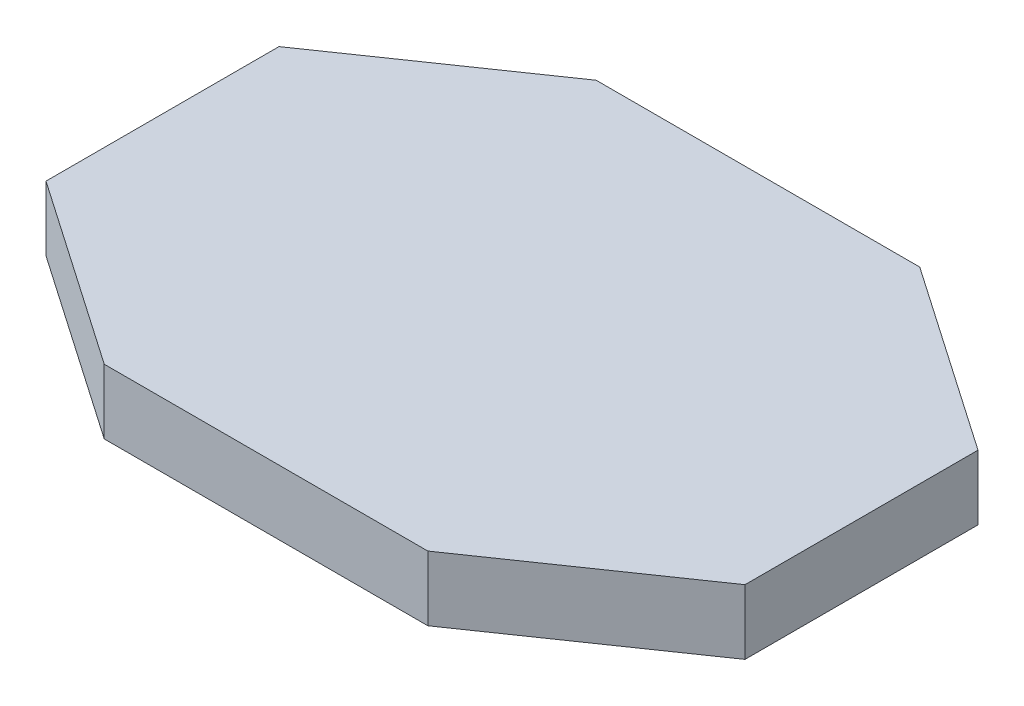
ISO-10303-21;
HEADER;
FILE_DESCRIPTION(('STEP AP214'),'2;1');
FILE_NAME('part.step','',(''),(''),'','','');
FILE_SCHEMA(('AUTOMOTIVE_DESIGN { 1 0 10303 214 1 1 1 1 }'));
ENDSEC;
DATA;
#1=APPLICATION_CONTEXT('core data for automotive mechanical design processes');
#2=APPLICATION_PROTOCOL_DEFINITION('international standard','automotive_design',2000,#1);
#3=PRODUCT_CONTEXT('',#1,'mechanical');
#4=PRODUCT('Part','Part','',(#3));
#5=PRODUCT_RELATED_PRODUCT_CATEGORY('part','',(#4));
#6=PRODUCT_DEFINITION_FORMATION('','',#4);
#7=PRODUCT_DEFINITION_CONTEXT('part definition',#1,'design');
#8=PRODUCT_DEFINITION('design','',#6,#7);
#9=PRODUCT_DEFINITION_SHAPE('','',#8);
#10=(LENGTH_UNIT() NAMED_UNIT(*) SI_UNIT(.MILLI.,.METRE.));
#11=(NAMED_UNIT(*) PLANE_ANGLE_UNIT() SI_UNIT($,.RADIAN.));
#12=(NAMED_UNIT(*) SI_UNIT($,.STERADIAN.) SOLID_ANGLE_UNIT());
#13=UNCERTAINTY_MEASURE_WITH_UNIT(LENGTH_MEASURE(1.E-05),#10,'distance_accuracy_value','');
#14=(GEOMETRIC_REPRESENTATION_CONTEXT(3) GLOBAL_UNCERTAINTY_ASSIGNED_CONTEXT((#13)) GLOBAL_UNIT_ASSIGNED_CONTEXT((#10,
#11,#12)) REPRESENTATION_CONTEXT('',''));
#15=CARTESIAN_POINT('',(0.,0.,0.));
#16=DIRECTION('',(0.,0.,1.));
#17=DIRECTION('',(1.,0.,0.));
#18=AXIS2_PLACEMENT_3D('',#15,#16,#17);
#19=CARTESIAN_POINT('',(0.,5.,0.));
#20=DIRECTION('',(0.,1.,0.));
#21=DIRECTION('',(0.,0.,1.));
#22=AXIS2_PLACEMENT_3D('',#19,#20,#21);
#23=PLANE('',#22);
#24=DIRECTION('',(-1.,0.,0.));
#25=VECTOR('',#24,1.);
#26=CARTESIAN_POINT('',(12.5,5.,-19.));
#27=LINE('',#26,#25);
#28=CARTESIAN_POINT('',(-12.5,5.,-19.));
#29=VERTEX_POINT('',#28);
#30=CARTESIAN_POINT('',(12.5000000000001,5.,-19.0000000000001));
#31=VERTEX_POINT('',#30);
#32=EDGE_CURVE('E93',#29,#31,#27,.F.);
#33=ORIENTED_EDGE('',*,*,#32,.F.);
#34=DIRECTION('',(-0.823212785915285,0.,0.56773295580369));
#35=VECTOR('',#34,1.);
#36=CARTESIAN_POINT('',(-12.5,5.,-19.));
#37=LINE('',#36,#35);
#38=CARTESIAN_POINT('',(-26.9999999999999,5.,-8.99999999999986));
#39=VERTEX_POINT('',#38);
#40=EDGE_CURVE('E19',#39,#29,#37,.F.);
#41=ORIENTED_EDGE('',*,*,#40,.F.);
#42=DIRECTION('',(0.,0.,1.));
#43=VECTOR('',#42,1.);
#44=CARTESIAN_POINT('',(-27.,5.,-9.));
#45=LINE('',#44,#43);
#46=CARTESIAN_POINT('',(-27.,5.,9.));
#47=VERTEX_POINT('',#46);
#48=EDGE_CURVE('E82',#47,#39,#45,.F.);
#49=ORIENTED_EDGE('',*,*,#48,.F.);
#50=DIRECTION('',(0.823212785915285,0.,0.56773295580369));
#51=VECTOR('',#50,1.);
#52=CARTESIAN_POINT('',(-27.,5.,9.));
#53=LINE('',#52,#51);
#54=CARTESIAN_POINT('',(-12.5000000000001,5.,19.0000000000001));
#55=VERTEX_POINT('',#54);
#56=EDGE_CURVE('E77',#55,#47,#53,.F.);
#57=ORIENTED_EDGE('',*,*,#56,.F.);
#58=DIRECTION('',(1.,0.,0.));
#59=VECTOR('',#58,1.);
#60=CARTESIAN_POINT('',(-12.5,5.,19.));
#61=LINE('',#60,#59);
#62=CARTESIAN_POINT('',(12.5,5.,19.));
#63=VERTEX_POINT('',#62);
#64=EDGE_CURVE('E104',#63,#55,#61,.F.);
#65=ORIENTED_EDGE('',*,*,#64,.F.);
#66=DIRECTION('',(0.823212785915285,0.,-0.56773295580369));
#67=VECTOR('',#66,1.);
#68=CARTESIAN_POINT('',(12.5,5.,19.));
#69=LINE('',#68,#67);
#70=CARTESIAN_POINT('',(26.9999999999999,5.,8.99999999999987));
#71=VERTEX_POINT('',#70);
#72=EDGE_CURVE('E108',#71,#63,#69,.F.);
#73=ORIENTED_EDGE('',*,*,#72,.F.);
#74=DIRECTION('',(0.,0.,-1.));
#75=VECTOR('',#74,1.);
#76=CARTESIAN_POINT('',(27.,5.,9.));
#77=LINE('',#76,#75);
#78=CARTESIAN_POINT('',(27.,5.,-9.));
#79=VERTEX_POINT('',#78);
#80=EDGE_CURVE('E112',#79,#71,#77,.F.);
#81=ORIENTED_EDGE('',*,*,#80,.F.);
#82=DIRECTION('',(-0.823212785915285,0.,-0.56773295580369));
#83=VECTOR('',#82,1.);
#84=CARTESIAN_POINT('',(27.,5.,-9.));
#85=LINE('',#84,#83);
#86=EDGE_CURVE('E116',#31,#79,#85,.F.);
#87=ORIENTED_EDGE('',*,*,#86,.F.);
#88=EDGE_LOOP('',(#33,#41,#49,#57,#65,#73,#81,#87));
#89=FACE_BOUND('',#88,.T.);
#90=ADVANCED_FACE('F16',(#89),#23,.T.);
#91=CARTESIAN_POINT('',(-12.5,0.,-19.));
#92=DIRECTION('',(-0.56773295580369,0.,-0.823212785915285));
#93=DIRECTION('',(-0.823212785915285,0.,0.56773295580369));
#94=AXIS2_PLACEMENT_3D('',#91,#92,#93);
#95=PLANE('',#94);
#96=DIRECTION('',(0.,1.,0.));
#97=VECTOR('',#96,1.);
#98=CARTESIAN_POINT('',(-12.5,0.,-19.));
#99=LINE('',#98,#97);
#100=CARTESIAN_POINT('',(-12.5,0.,-19.));
#101=VERTEX_POINT('',#100);
#102=EDGE_CURVE('E120',#101,#29,#99,.T.);
#103=ORIENTED_EDGE('',*,*,#102,.F.);
#104=DIRECTION('',(-0.823212785915306,0.,0.56773295580366));
#105=VECTOR('',#104,1.);
#106=CARTESIAN_POINT('',(-12.5,0.,-19.));
#107=LINE('',#106,#105);
#108=CARTESIAN_POINT('',(-26.9999999999998,0.,-8.99999999999973));
#109=VERTEX_POINT('',#108);
#110=EDGE_CURVE('E99',#101,#109,#107,.T.);
#111=ORIENTED_EDGE('',*,*,#110,.T.);
#112=DIRECTION('',(0.,1.,0.));
#113=VECTOR('',#112,1.);
#114=CARTESIAN_POINT('',(-27.,0.,-9.));
#115=LINE('',#114,#113);
#116=EDGE_CURVE('E87',#39,#109,#115,.F.);
#117=ORIENTED_EDGE('',*,*,#116,.F.);
#118=ORIENTED_EDGE('',*,*,#40,.T.);
#119=EDGE_LOOP('',(#103,#111,#117,#118));
#120=FACE_BOUND('',#119,.T.);
#121=ADVANCED_FACE('F98',(#120),#95,.T.);
#122=CARTESIAN_POINT('',(-27.,0.,-9.));
#123=DIRECTION('',(-1.,0.,0.));
#124=DIRECTION('',(0.,0.,1.));
#125=AXIS2_PLACEMENT_3D('',#122,#123,#124);
#126=PLANE('',#125);
#127=ORIENTED_EDGE('',*,*,#116,.T.);
#128=DIRECTION('',(0.,0.,1.));
#129=VECTOR('',#128,1.);
#130=CARTESIAN_POINT('',(-27.,0.,0.));
#131=LINE('',#130,#129);
#132=CARTESIAN_POINT('',(-27.,0.,9.));
#133=VERTEX_POINT('',#132);
#134=EDGE_CURVE('E125',#109,#133,#131,.T.);
#135=ORIENTED_EDGE('',*,*,#134,.T.);
#136=DIRECTION('',(0.,1.,0.));
#137=VECTOR('',#136,1.);
#138=CARTESIAN_POINT('',(-27.,0.,9.));
#139=LINE('',#138,#137);
#140=EDGE_CURVE('E89',#47,#133,#139,.F.);
#141=ORIENTED_EDGE('',*,*,#140,.F.);
#142=ORIENTED_EDGE('',*,*,#48,.T.);
#143=EDGE_LOOP('',(#127,#135,#141,#142));
#144=FACE_BOUND('',#143,.T.);
#145=ADVANCED_FACE('F84',(#144),#126,.T.);
#146=CARTESIAN_POINT('',(-27.,0.,9.));
#147=DIRECTION('',(-0.56773295580369,0.,0.823212785915285));
#148=DIRECTION('',(0.823212785915285,0.,0.56773295580369));
#149=AXIS2_PLACEMENT_3D('',#146,#147,#148);
#150=PLANE('',#149);
#151=ORIENTED_EDGE('',*,*,#140,.T.);
#152=DIRECTION('',(0.823212785915306,0.,0.56773295580366));
#153=VECTOR('',#152,1.);
#154=CARTESIAN_POINT('',(-27.,0.,9.));
#155=LINE('',#154,#153);
#156=CARTESIAN_POINT('',(-12.5000000000002,0.,19.0000000000003));
#157=VERTEX_POINT('',#156);
#158=EDGE_CURVE('E127',#133,#157,#155,.T.);
#159=ORIENTED_EDGE('',*,*,#158,.T.);
#160=DIRECTION('',(0.,1.,0.));
#161=VECTOR('',#160,1.);
#162=CARTESIAN_POINT('',(-12.5,0.,19.));
#163=LINE('',#162,#161);
#164=EDGE_CURVE('E106',#55,#157,#163,.F.);
#165=ORIENTED_EDGE('',*,*,#164,.F.);
#166=ORIENTED_EDGE('',*,*,#56,.T.);
#167=EDGE_LOOP('',(#151,#159,#165,#166));
#168=FACE_BOUND('',#167,.T.);
#169=ADVANCED_FACE('F161',(#168),#150,.T.);
#170=CARTESIAN_POINT('',(-12.5,0.,19.));
#171=DIRECTION('',(0.,0.,1.));
#172=DIRECTION('',(1.,0.,0.));
#173=AXIS2_PLACEMENT_3D('',#170,#171,#172);
#174=PLANE('',#173);
#175=ORIENTED_EDGE('',*,*,#164,.T.);
#176=DIRECTION('',(1.,0.,0.));
#177=VECTOR('',#176,1.);
#178=CARTESIAN_POINT('',(0.,0.,19.));
#179=LINE('',#178,#177);
#180=CARTESIAN_POINT('',(12.5,0.,19.));
#181=VERTEX_POINT('',#180);
#182=EDGE_CURVE('E130',#157,#181,#179,.T.);
#183=ORIENTED_EDGE('',*,*,#182,.T.);
#184=DIRECTION('',(0.,1.,0.));
#185=VECTOR('',#184,1.);
#186=CARTESIAN_POINT('',(12.5,0.,19.));
#187=LINE('',#186,#185);
#188=EDGE_CURVE('E110',#63,#181,#187,.F.);
#189=ORIENTED_EDGE('',*,*,#188,.F.);
#190=ORIENTED_EDGE('',*,*,#64,.T.);
#191=EDGE_LOOP('',(#175,#183,#189,#190));
#192=FACE_BOUND('',#191,.T.);
#193=ADVANCED_FACE('F160',(#192),#174,.T.);
#194=CARTESIAN_POINT('',(12.5,0.,19.));
#195=DIRECTION('',(0.56773295580369,0.,0.823212785915285));
#196=DIRECTION('',(0.823212785915285,0.,-0.56773295580369));
#197=AXIS2_PLACEMENT_3D('',#194,#195,#196);
#198=PLANE('',#197);
#199=ORIENTED_EDGE('',*,*,#188,.T.);
#200=DIRECTION('',(0.823212785915306,0.,-0.56773295580366));
#201=VECTOR('',#200,1.);
#202=CARTESIAN_POINT('',(12.5,0.,19.));
#203=LINE('',#202,#201);
#204=CARTESIAN_POINT('',(26.9999999999998,0.,8.99999999999973));
#205=VERTEX_POINT('',#204);
#206=EDGE_CURVE('E133',#181,#205,#203,.T.);
#207=ORIENTED_EDGE('',*,*,#206,.T.);
#208=DIRECTION('',(0.,1.,0.));
#209=VECTOR('',#208,1.);
#210=CARTESIAN_POINT('',(27.,0.,9.));
#211=LINE('',#210,#209);
#212=EDGE_CURVE('E114',#71,#205,#211,.F.);
#213=ORIENTED_EDGE('',*,*,#212,.F.);
#214=ORIENTED_EDGE('',*,*,#72,.T.);
#215=EDGE_LOOP('',(#199,#207,#213,#214));
#216=FACE_BOUND('',#215,.T.);
#217=ADVANCED_FACE('F154',(#216),#198,.T.);
#218=CARTESIAN_POINT('',(27.,0.,9.));
#219=DIRECTION('',(1.,0.,0.));
#220=DIRECTION('',(0.,0.,-1.));
#221=AXIS2_PLACEMENT_3D('',#218,#219,#220);
#222=PLANE('',#221);
#223=ORIENTED_EDGE('',*,*,#212,.T.);
#224=DIRECTION('',(0.,0.,1.));
#225=VECTOR('',#224,1.);
#226=CARTESIAN_POINT('',(27.,0.,0.));
#227=LINE('',#226,#225);
#228=CARTESIAN_POINT('',(27.,0.,-9.));
#229=VERTEX_POINT('',#228);
#230=EDGE_CURVE('E136',#205,#229,#227,.F.);
#231=ORIENTED_EDGE('',*,*,#230,.T.);
#232=DIRECTION('',(0.,1.,0.));
#233=VECTOR('',#232,1.);
#234=CARTESIAN_POINT('',(27.,0.,-9.));
#235=LINE('',#234,#233);
#236=EDGE_CURVE('E118',#79,#229,#235,.F.);
#237=ORIENTED_EDGE('',*,*,#236,.F.);
#238=ORIENTED_EDGE('',*,*,#80,.T.);
#239=EDGE_LOOP('',(#223,#231,#237,#238));
#240=FACE_BOUND('',#239,.T.);
#241=ADVANCED_FACE('F149',(#240),#222,.T.);
#242=CARTESIAN_POINT('',(27.,0.,-9.));
#243=DIRECTION('',(0.56773295580369,0.,-0.823212785915285));
#244=DIRECTION('',(-0.823212785915285,0.,-0.56773295580369));
#245=AXIS2_PLACEMENT_3D('',#242,#243,#244);
#246=PLANE('',#245);
#247=ORIENTED_EDGE('',*,*,#236,.T.);
#248=DIRECTION('',(-0.823212785915306,0.,-0.56773295580366));
#249=VECTOR('',#248,1.);
#250=CARTESIAN_POINT('',(27.,0.,-9.));
#251=LINE('',#250,#249);
#252=CARTESIAN_POINT('',(12.5000000000002,0.,-19.0000000000003));
#253=VERTEX_POINT('',#252);
#254=EDGE_CURVE('E25',#229,#253,#251,.T.);
#255=ORIENTED_EDGE('',*,*,#254,.T.);
#256=DIRECTION('',(0.,1.,0.));
#257=VECTOR('',#256,1.);
#258=CARTESIAN_POINT('',(12.5,0.,-19.));
#259=LINE('',#258,#257);
#260=EDGE_CURVE('E33',#31,#253,#259,.F.);
#261=ORIENTED_EDGE('',*,*,#260,.F.);
#262=ORIENTED_EDGE('',*,*,#86,.T.);
#263=EDGE_LOOP('',(#247,#255,#261,#262));
#264=FACE_BOUND('',#263,.T.);
#265=ADVANCED_FACE('F142',(#264),#246,.T.);
#266=CARTESIAN_POINT('',(12.5,0.,-19.));
#267=DIRECTION('',(0.,0.,-1.));
#268=DIRECTION('',(-1.,0.,0.));
#269=AXIS2_PLACEMENT_3D('',#266,#267,#268);
#270=PLANE('',#269);
#271=ORIENTED_EDGE('',*,*,#260,.T.);
#272=DIRECTION('',(1.,0.,0.));
#273=VECTOR('',#272,1.);
#274=CARTESIAN_POINT('',(0.,0.,-19.));
#275=LINE('',#274,#273);
#276=EDGE_CURVE('E11',#253,#101,#275,.F.);
#277=ORIENTED_EDGE('',*,*,#276,.T.);
#278=ORIENTED_EDGE('',*,*,#102,.T.);
#279=ORIENTED_EDGE('',*,*,#32,.T.);
#280=EDGE_LOOP('',(#271,#277,#278,#279));
#281=FACE_BOUND('',#280,.T.);
#282=ADVANCED_FACE('F162',(#281),#270,.T.);
#283=CARTESIAN_POINT('',(0.,0.,0.));
#284=DIRECTION('',(0.,1.,0.));
#285=DIRECTION('',(0.,0.,1.));
#286=AXIS2_PLACEMENT_3D('',#283,#284,#285);
#287=PLANE('',#286);
#288=ORIENTED_EDGE('',*,*,#254,.F.);
#289=ORIENTED_EDGE('',*,*,#230,.F.);
#290=ORIENTED_EDGE('',*,*,#206,.F.);
#291=ORIENTED_EDGE('',*,*,#182,.F.);
#292=ORIENTED_EDGE('',*,*,#158,.F.);
#293=ORIENTED_EDGE('',*,*,#134,.F.);
#294=ORIENTED_EDGE('',*,*,#110,.F.);
#295=ORIENTED_EDGE('',*,*,#276,.F.);
#296=EDGE_LOOP('',(#288,#289,#290,#291,#292,#293,#294,#295));
#297=FACE_BOUND('',#296,.T.);
#298=ADVANCED_FACE('F146',(#297),#287,.F.);
#299=CLOSED_SHELL('',(#90,#121,#145,#169,#193,#217,#241,#265,#282,#298));
#300=MANIFOLD_SOLID_BREP('B1',#299);
#301=ADVANCED_BREP_SHAPE_REPRESENTATION('',(#18,#300),#14);
#302=SHAPE_DEFINITION_REPRESENTATION(#9,#301);
ENDSEC;
END-ISO-10303-21;
